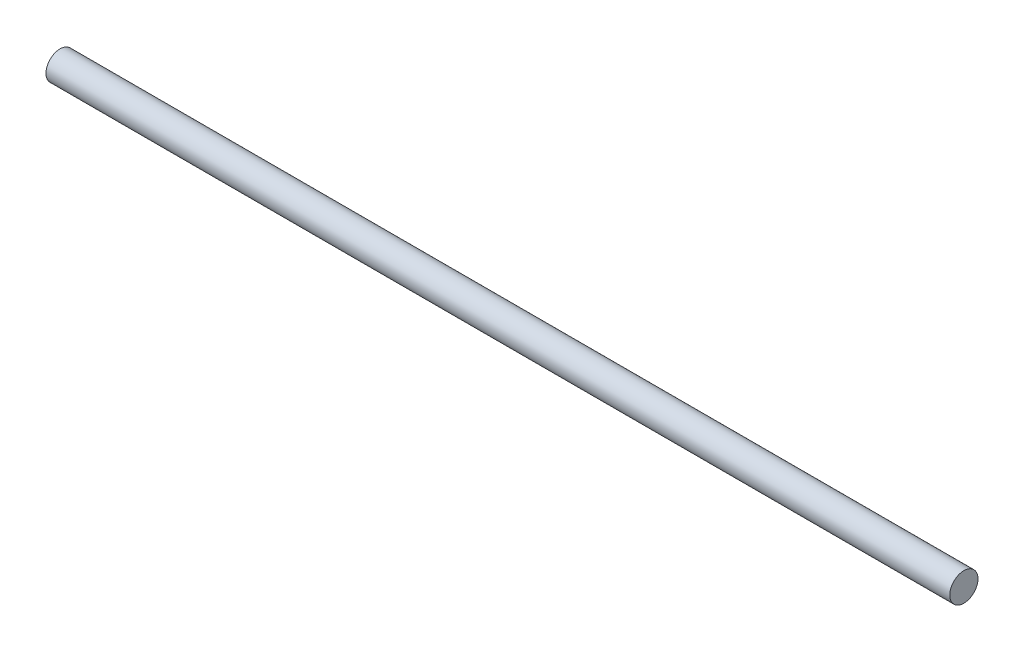
ISO-10303-21;
HEADER;
FILE_DESCRIPTION(('STEP AP214'),'2;1');
FILE_NAME('part.step','',(''),(''),'','','');
FILE_SCHEMA(('AUTOMOTIVE_DESIGN { 1 0 10303 214 1 1 1 1 }'));
ENDSEC;
DATA;
#1=APPLICATION_CONTEXT('core data for automotive mechanical design processes');
#2=APPLICATION_PROTOCOL_DEFINITION('international standard','automotive_design',2000,#1);
#3=PRODUCT_CONTEXT('',#1,'mechanical');
#4=PRODUCT('Part','Part','',(#3));
#5=PRODUCT_RELATED_PRODUCT_CATEGORY('part','',(#4));
#6=PRODUCT_DEFINITION_FORMATION('','',#4);
#7=PRODUCT_DEFINITION_CONTEXT('part definition',#1,'design');
#8=PRODUCT_DEFINITION('design','',#6,#7);
#9=PRODUCT_DEFINITION_SHAPE('','',#8);
#10=(LENGTH_UNIT() NAMED_UNIT(*) SI_UNIT(.MILLI.,.METRE.));
#11=(NAMED_UNIT(*) PLANE_ANGLE_UNIT() SI_UNIT($,.RADIAN.));
#12=(NAMED_UNIT(*) SI_UNIT($,.STERADIAN.) SOLID_ANGLE_UNIT());
#13=UNCERTAINTY_MEASURE_WITH_UNIT(LENGTH_MEASURE(1.E-05),#10,'distance_accuracy_value','');
#14=(GEOMETRIC_REPRESENTATION_CONTEXT(3) GLOBAL_UNCERTAINTY_ASSIGNED_CONTEXT((#13)) GLOBAL_UNIT_ASSIGNED_CONTEXT((#10,
#11,#12)) REPRESENTATION_CONTEXT('',''));
#15=CARTESIAN_POINT('',(0.,0.,0.));
#16=DIRECTION('',(0.,0.,1.));
#17=DIRECTION('',(1.,0.,0.));
#18=AXIS2_PLACEMENT_3D('',#15,#16,#17);
#19=CARTESIAN_POINT('',(101.6,0.,0.));
#20=DIRECTION('',(1.,0.,0.));
#21=DIRECTION('',(0.,0.,-1.));
#22=AXIS2_PLACEMENT_3D('',#19,#20,#21);
#23=PLANE('',#22);
#24=CARTESIAN_POINT('',(101.6,0.,0.));
#25=DIRECTION('',(1.,0.,0.));
#26=DIRECTION('',(0.,0.,-1.));
#27=AXIS2_PLACEMENT_3D('',#24,#25,#26);
#28=CIRCLE('',#27,3.175);
#29=CARTESIAN_POINT('',(101.6,0.,-3.175));
#30=VERTEX_POINT('',#29);
#31=EDGE_CURVE('E17',#30,#30,#28,.F.);
#32=ORIENTED_EDGE('',*,*,#31,.F.);
#33=EDGE_LOOP('',(#32));
#34=FACE_BOUND('',#33,.T.);
#35=ADVANCED_FACE('F14',(#34),#23,.T.);
#36=CARTESIAN_POINT('',(-101.6,0.,0.));
#37=DIRECTION('',(1.,0.,0.));
#38=DIRECTION('',(0.,0.,-1.));
#39=AXIS2_PLACEMENT_3D('',#36,#37,#38);
#40=PLANE('',#39);
#41=CARTESIAN_POINT('',(-101.6,0.,0.));
#42=DIRECTION('',(1.,0.,0.));
#43=DIRECTION('',(0.,0.,-1.));
#44=AXIS2_PLACEMENT_3D('',#41,#42,#43);
#45=CIRCLE('',#44,3.175);
#46=CARTESIAN_POINT('',(-101.6,0.,-3.175));
#47=VERTEX_POINT('',#46);
#48=EDGE_CURVE('E10',#47,#47,#45,.T.);
#49=ORIENTED_EDGE('',*,*,#48,.F.);
#50=EDGE_LOOP('',(#49));
#51=FACE_BOUND('',#50,.T.);
#52=ADVANCED_FACE('F29',(#51),#40,.F.);
#53=CARTESIAN_POINT('',(-101.6,0.,0.));
#54=DIRECTION('',(1.,0.,0.));
#55=DIRECTION('',(0.,0.,-1.));
#56=AXIS2_PLACEMENT_3D('',#53,#54,#55);
#57=CYLINDRICAL_SURFACE('',#56,3.175);
#58=ORIENTED_EDGE('',*,*,#31,.T.);
#59=EDGE_LOOP('',(#58));
#60=FACE_BOUND('',#59,.T.);
#61=ORIENTED_EDGE('',*,*,#48,.T.);
#62=EDGE_LOOP('',(#61));
#63=FACE_BOUND('',#62,.T.);
#64=ADVANCED_FACE('F26',(#60,#63),#57,.T.);
#65=CLOSED_SHELL('',(#35,#52,#64));
#66=MANIFOLD_SOLID_BREP('B1',#65);
#67=ADVANCED_BREP_SHAPE_REPRESENTATION('',(#18,#66),#14);
#68=SHAPE_DEFINITION_REPRESENTATION(#9,#67);
ENDSEC;
END-ISO-10303-21;
